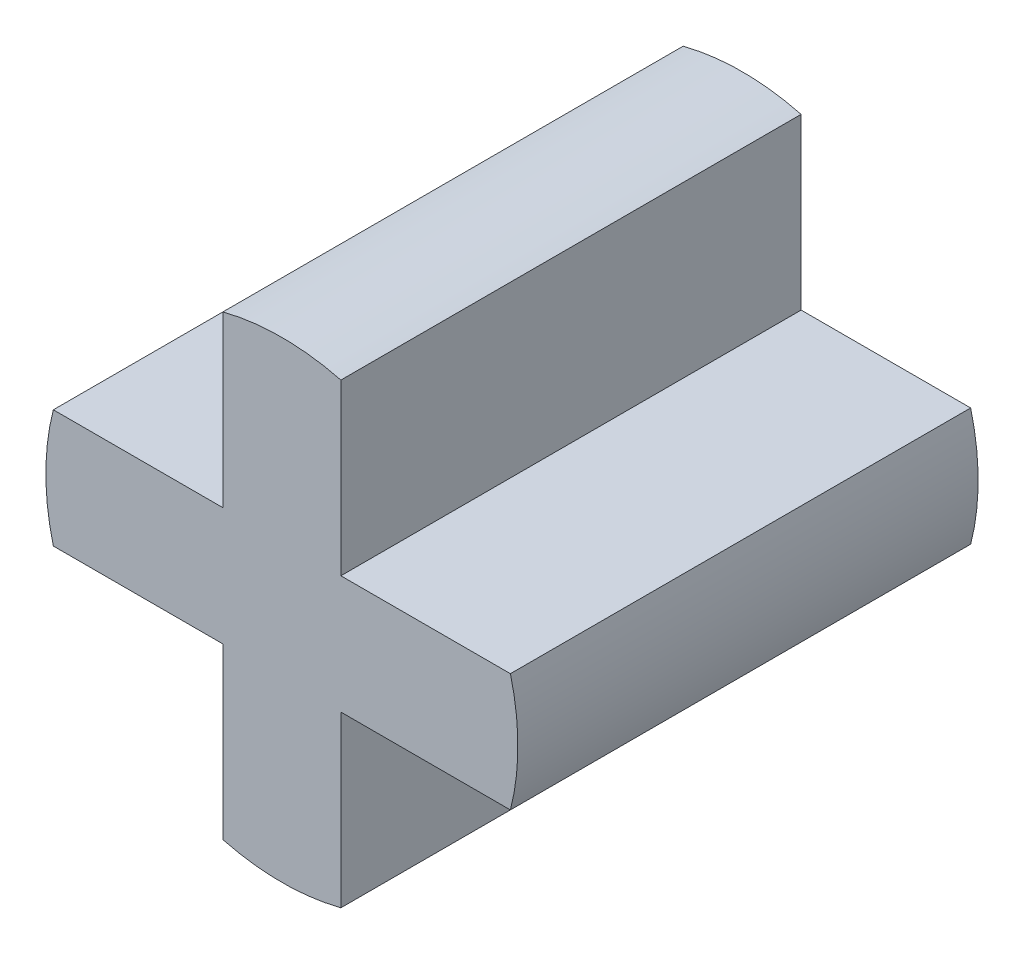
ISO-10303-21;
HEADER;
FILE_DESCRIPTION(('STEP AP214'),'2;1');
FILE_NAME('part.step','',(''),(''),'','','');
FILE_SCHEMA(('AUTOMOTIVE_DESIGN { 1 0 10303 214 1 1 1 1 }'));
ENDSEC;
DATA;
#1=APPLICATION_CONTEXT('core data for automotive mechanical design processes');
#2=APPLICATION_PROTOCOL_DEFINITION('international standard','automotive_design',2000,#1);
#3=PRODUCT_CONTEXT('',#1,'mechanical');
#4=PRODUCT('Part','Part','',(#3));
#5=PRODUCT_RELATED_PRODUCT_CATEGORY('part','',(#4));
#6=PRODUCT_DEFINITION_FORMATION('','',#4);
#7=PRODUCT_DEFINITION_CONTEXT('part definition',#1,'design');
#8=PRODUCT_DEFINITION('design','',#6,#7);
#9=PRODUCT_DEFINITION_SHAPE('','',#8);
#10=(LENGTH_UNIT() NAMED_UNIT(*) SI_UNIT(.MILLI.,.METRE.));
#11=(NAMED_UNIT(*) PLANE_ANGLE_UNIT() SI_UNIT($,.RADIAN.));
#12=(NAMED_UNIT(*) SI_UNIT($,.STERADIAN.) SOLID_ANGLE_UNIT());
#13=UNCERTAINTY_MEASURE_WITH_UNIT(LENGTH_MEASURE(1.E-05),#10,'distance_accuracy_value','');
#14=(GEOMETRIC_REPRESENTATION_CONTEXT(3) GLOBAL_UNCERTAINTY_ASSIGNED_CONTEXT((#13)) GLOBAL_UNIT_ASSIGNED_CONTEXT((#10,
#11,#12)) REPRESENTATION_CONTEXT('',''));
#15=CARTESIAN_POINT('',(0.,0.,0.));
#16=DIRECTION('',(0.,0.,1.));
#17=DIRECTION('',(1.,0.,0.));
#18=AXIS2_PLACEMENT_3D('',#15,#16,#17);
#19=CARTESIAN_POINT('',(3.87298334620742,0.999999999999999,7.8));
#20=DIRECTION('',(0.,-1.,0.));
#21=DIRECTION('',(1.,0.,0.));
#22=AXIS2_PLACEMENT_3D('',#19,#20,#21);
#23=PLANE('',#22);
#24=DIRECTION('',(-1.,0.,0.));
#25=VECTOR('',#24,1.);
#26=CARTESIAN_POINT('',(3.87298334620742,0.999999999999999,0.));
#27=LINE('',#26,#25);
#28=CARTESIAN_POINT('',(3.87298334620742,1.,0.));
#29=VERTEX_POINT('',#28);
#30=CARTESIAN_POINT('',(1.,1.,0.));
#31=VERTEX_POINT('',#30);
#32=EDGE_CURVE('E153',#29,#31,#27,.T.);
#33=ORIENTED_EDGE('',*,*,#32,.T.);
#34=DIRECTION('',(0.,0.,-1.));
#35=VECTOR('',#34,1.);
#36=CARTESIAN_POINT('',(1.,1.,7.8));
#37=LINE('',#36,#35);
#38=CARTESIAN_POINT('',(1.,1.,7.8));
#39=VERTEX_POINT('',#38);
#40=EDGE_CURVE('E11',#39,#31,#37,.T.);
#41=ORIENTED_EDGE('',*,*,#40,.F.);
#42=DIRECTION('',(-1.,0.,0.));
#43=VECTOR('',#42,1.);
#44=CARTESIAN_POINT('',(3.87298334620742,0.999999999999999,7.8));
#45=LINE('',#44,#43);
#46=CARTESIAN_POINT('',(3.87298334620742,1.,7.8));
#47=VERTEX_POINT('',#46);
#48=EDGE_CURVE('E175',#47,#39,#45,.T.);
#49=ORIENTED_EDGE('',*,*,#48,.F.);
#50=DIRECTION('',(0.,0.,-1.));
#51=VECTOR('',#50,1.);
#52=CARTESIAN_POINT('',(3.87298334620742,1.,7.8));
#53=LINE('',#52,#51);
#54=EDGE_CURVE('E149',#47,#29,#53,.T.);
#55=ORIENTED_EDGE('',*,*,#54,.T.);
#56=EDGE_LOOP('',(#33,#41,#49,#55));
#57=FACE_BOUND('',#56,.T.);
#58=ADVANCED_FACE('F33',(#57),#23,.F.);
#59=CARTESIAN_POINT('',(1.,1.,7.8));
#60=DIRECTION('',(-1.,0.,0.));
#61=DIRECTION('',(0.,-1.,0.));
#62=AXIS2_PLACEMENT_3D('',#59,#60,#61);
#63=PLANE('',#62);
#64=DIRECTION('',(0.,1.,0.));
#65=VECTOR('',#64,1.);
#66=CARTESIAN_POINT('',(1.,1.,0.));
#67=LINE('',#66,#65);
#68=CARTESIAN_POINT('',(0.999999999999999,3.87298334620742,0.));
#69=VERTEX_POINT('',#68);
#70=EDGE_CURVE('E156',#31,#69,#67,.T.);
#71=ORIENTED_EDGE('',*,*,#70,.T.);
#72=DIRECTION('',(0.,0.,-1.));
#73=VECTOR('',#72,1.);
#74=CARTESIAN_POINT('',(0.999999999999999,3.87298334620742,7.8));
#75=LINE('',#74,#73);
#76=CARTESIAN_POINT('',(0.999999999999999,3.87298334620742,7.8));
#77=VERTEX_POINT('',#76);
#78=EDGE_CURVE('E41',#77,#69,#75,.T.);
#79=ORIENTED_EDGE('',*,*,#78,.F.);
#80=DIRECTION('',(0.,1.,0.));
#81=VECTOR('',#80,1.);
#82=CARTESIAN_POINT('',(1.,1.,7.8));
#83=LINE('',#82,#81);
#84=EDGE_CURVE('E104',#39,#77,#83,.T.);
#85=ORIENTED_EDGE('',*,*,#84,.F.);
#86=ORIENTED_EDGE('',*,*,#40,.T.);
#87=EDGE_LOOP('',(#71,#79,#85,#86));
#88=FACE_BOUND('',#87,.T.);
#89=ADVANCED_FACE('F253',(#88),#63,.F.);
#90=CARTESIAN_POINT('',(0.,0.,7.8));
#91=DIRECTION('',(0.,0.,-1.));
#92=DIRECTION('',(-1.,0.,0.));
#93=AXIS2_PLACEMENT_3D('',#90,#91,#92);
#94=CYLINDRICAL_SURFACE('',#93,4.);
#95=CARTESIAN_POINT('',(0.,0.,0.));
#96=DIRECTION('',(0.,0.,1.));
#97=DIRECTION('',(1.,0.,0.));
#98=AXIS2_PLACEMENT_3D('',#95,#96,#97);
#99=CIRCLE('',#98,4.);
#100=CARTESIAN_POINT('',(-1.,3.87298334620742,0.));
#101=VERTEX_POINT('',#100);
#102=EDGE_CURVE('E158',#69,#101,#99,.T.);
#103=ORIENTED_EDGE('',*,*,#102,.T.);
#104=DIRECTION('',(0.,0.,-1.));
#105=VECTOR('',#104,1.);
#106=CARTESIAN_POINT('',(-1.,3.87298334620742,7.8));
#107=LINE('',#106,#105);
#108=CARTESIAN_POINT('',(-1.,3.87298334620742,7.8));
#109=VERTEX_POINT('',#108);
#110=EDGE_CURVE('E194',#109,#101,#107,.T.);
#111=ORIENTED_EDGE('',*,*,#110,.F.);
#112=CARTESIAN_POINT('',(0.,0.,7.8));
#113=DIRECTION('',(0.,0.,1.));
#114=DIRECTION('',(1.,0.,0.));
#115=AXIS2_PLACEMENT_3D('',#112,#113,#114);
#116=CIRCLE('',#115,4.);
#117=EDGE_CURVE('E202',#77,#109,#116,.T.);
#118=ORIENTED_EDGE('',*,*,#117,.F.);
#119=ORIENTED_EDGE('',*,*,#78,.T.);
#120=EDGE_LOOP('',(#103,#111,#118,#119));
#121=FACE_BOUND('',#120,.T.);
#122=ADVANCED_FACE('F200',(#121),#94,.T.);
#123=CARTESIAN_POINT('',(-1.,3.87298334620742,7.8));
#124=DIRECTION('',(1.,0.,0.));
#125=DIRECTION('',(0.,1.,0.));
#126=AXIS2_PLACEMENT_3D('',#123,#124,#125);
#127=PLANE('',#126);
#128=DIRECTION('',(0.,-1.,0.));
#129=VECTOR('',#128,1.);
#130=CARTESIAN_POINT('',(-1.,3.87298334620742,0.));
#131=LINE('',#130,#129);
#132=CARTESIAN_POINT('',(-1.,1.,0.));
#133=VERTEX_POINT('',#132);
#134=EDGE_CURVE('E160',#101,#133,#131,.T.);
#135=ORIENTED_EDGE('',*,*,#134,.T.);
#136=DIRECTION('',(0.,0.,-1.));
#137=VECTOR('',#136,1.);
#138=CARTESIAN_POINT('',(-1.,1.,7.8));
#139=LINE('',#138,#137);
#140=CARTESIAN_POINT('',(-1.,1.,7.8));
#141=VERTEX_POINT('',#140);
#142=EDGE_CURVE('E191',#141,#133,#139,.T.);
#143=ORIENTED_EDGE('',*,*,#142,.F.);
#144=DIRECTION('',(0.,-1.,0.));
#145=VECTOR('',#144,1.);
#146=CARTESIAN_POINT('',(-1.,3.87298334620742,7.8));
#147=LINE('',#146,#145);
#148=EDGE_CURVE('E220',#109,#141,#147,.T.);
#149=ORIENTED_EDGE('',*,*,#148,.F.);
#150=ORIENTED_EDGE('',*,*,#110,.T.);
#151=EDGE_LOOP('',(#135,#143,#149,#150));
#152=FACE_BOUND('',#151,.T.);
#153=ADVANCED_FACE('F211',(#152),#127,.F.);
#154=CARTESIAN_POINT('',(-1.,1.,7.8));
#155=DIRECTION('',(0.,-1.,0.));
#156=DIRECTION('',(1.,0.,0.));
#157=AXIS2_PLACEMENT_3D('',#154,#155,#156);
#158=PLANE('',#157);
#159=DIRECTION('',(-1.,0.,0.));
#160=VECTOR('',#159,1.);
#161=CARTESIAN_POINT('',(-1.,1.,0.));
#162=LINE('',#161,#160);
#163=CARTESIAN_POINT('',(-3.87298334620742,0.999999999999999,0.));
#164=VERTEX_POINT('',#163);
#165=EDGE_CURVE('E162',#133,#164,#162,.T.);
#166=ORIENTED_EDGE('',*,*,#165,.T.);
#167=DIRECTION('',(0.,0.,-1.));
#168=VECTOR('',#167,1.);
#169=CARTESIAN_POINT('',(-3.87298334620742,0.999999999999999,7.8));
#170=LINE('',#169,#168);
#171=CARTESIAN_POINT('',(-3.87298334620742,0.999999999999999,7.8));
#172=VERTEX_POINT('',#171);
#173=EDGE_CURVE('E188',#172,#164,#170,.T.);
#174=ORIENTED_EDGE('',*,*,#173,.F.);
#175=DIRECTION('',(-1.,0.,0.));
#176=VECTOR('',#175,1.);
#177=CARTESIAN_POINT('',(-1.,1.,7.8));
#178=LINE('',#177,#176);
#179=EDGE_CURVE('E217',#141,#172,#178,.T.);
#180=ORIENTED_EDGE('',*,*,#179,.F.);
#181=ORIENTED_EDGE('',*,*,#142,.T.);
#182=EDGE_LOOP('',(#166,#174,#180,#181));
#183=FACE_BOUND('',#182,.T.);
#184=ADVANCED_FACE('F215',(#183),#158,.F.);
#185=CARTESIAN_POINT('',(0.,0.,7.8));
#186=DIRECTION('',(0.,0.,-1.));
#187=DIRECTION('',(-1.,0.,0.));
#188=AXIS2_PLACEMENT_3D('',#185,#186,#187);
#189=CYLINDRICAL_SURFACE('',#188,4.);
#190=CARTESIAN_POINT('',(0.,0.,0.));
#191=DIRECTION('',(0.,0.,1.));
#192=DIRECTION('',(1.,0.,0.));
#193=AXIS2_PLACEMENT_3D('',#190,#191,#192);
#194=CIRCLE('',#193,4.);
#195=CARTESIAN_POINT('',(-3.87298334620742,-0.999999999999999,0.));
#196=VERTEX_POINT('',#195);
#197=EDGE_CURVE('E164',#164,#196,#194,.T.);
#198=ORIENTED_EDGE('',*,*,#197,.T.);
#199=DIRECTION('',(0.,0.,-1.));
#200=VECTOR('',#199,1.);
#201=CARTESIAN_POINT('',(-3.87298334620742,-0.999999999999999,7.8));
#202=LINE('',#201,#200);
#203=CARTESIAN_POINT('',(-3.87298334620742,-0.999999999999999,7.8));
#204=VERTEX_POINT('',#203);
#205=EDGE_CURVE('E185',#204,#196,#202,.T.);
#206=ORIENTED_EDGE('',*,*,#205,.F.);
#207=CARTESIAN_POINT('',(0.,0.,7.8));
#208=DIRECTION('',(0.,0.,1.));
#209=DIRECTION('',(1.,0.,0.));
#210=AXIS2_PLACEMENT_3D('',#207,#208,#209);
#211=CIRCLE('',#210,4.);
#212=EDGE_CURVE('E219',#172,#204,#211,.T.);
#213=ORIENTED_EDGE('',*,*,#212,.F.);
#214=ORIENTED_EDGE('',*,*,#173,.T.);
#215=EDGE_LOOP('',(#198,#206,#213,#214));
#216=FACE_BOUND('',#215,.T.);
#217=ADVANCED_FACE('F266',(#216),#189,.T.);
#218=CARTESIAN_POINT('',(-3.87298334620742,-0.999999999999999,7.8));
#219=DIRECTION('',(0.,1.,0.));
#220=DIRECTION('',(-1.,0.,0.));
#221=AXIS2_PLACEMENT_3D('',#218,#219,#220);
#222=PLANE('',#221);
#223=DIRECTION('',(1.,0.,0.));
#224=VECTOR('',#223,1.);
#225=CARTESIAN_POINT('',(-3.87298334620742,-0.999999999999999,0.));
#226=LINE('',#225,#224);
#227=CARTESIAN_POINT('',(-1.,-1.,0.));
#228=VERTEX_POINT('',#227);
#229=EDGE_CURVE('E166',#196,#228,#226,.T.);
#230=ORIENTED_EDGE('',*,*,#229,.T.);
#231=DIRECTION('',(0.,0.,-1.));
#232=VECTOR('',#231,1.);
#233=CARTESIAN_POINT('',(-1.,-1.,7.8));
#234=LINE('',#233,#232);
#235=CARTESIAN_POINT('',(-1.,-1.,7.8));
#236=VERTEX_POINT('',#235);
#237=EDGE_CURVE('E182',#236,#228,#234,.T.);
#238=ORIENTED_EDGE('',*,*,#237,.F.);
#239=DIRECTION('',(1.,0.,0.));
#240=VECTOR('',#239,1.);
#241=CARTESIAN_POINT('',(-3.87298334620742,-0.999999999999999,7.8));
#242=LINE('',#241,#240);
#243=EDGE_CURVE('E222',#204,#236,#242,.T.);
#244=ORIENTED_EDGE('',*,*,#243,.F.);
#245=ORIENTED_EDGE('',*,*,#205,.T.);
#246=EDGE_LOOP('',(#230,#238,#244,#245));
#247=FACE_BOUND('',#246,.T.);
#248=ADVANCED_FACE('F269',(#247),#222,.F.);
#249=CARTESIAN_POINT('',(-1.,-1.,7.8));
#250=DIRECTION('',(1.,0.,0.));
#251=DIRECTION('',(0.,1.,0.));
#252=AXIS2_PLACEMENT_3D('',#249,#250,#251);
#253=PLANE('',#252);
#254=DIRECTION('',(0.,-1.,0.));
#255=VECTOR('',#254,1.);
#256=CARTESIAN_POINT('',(-1.,-1.,0.));
#257=LINE('',#256,#255);
#258=CARTESIAN_POINT('',(-1.,-3.87298334620742,0.));
#259=VERTEX_POINT('',#258);
#260=EDGE_CURVE('E168',#228,#259,#257,.T.);
#261=ORIENTED_EDGE('',*,*,#260,.T.);
#262=DIRECTION('',(0.,0.,-1.));
#263=VECTOR('',#262,1.);
#264=CARTESIAN_POINT('',(-1.,-3.87298334620742,7.8));
#265=LINE('',#264,#263);
#266=CARTESIAN_POINT('',(-1.,-3.87298334620742,7.8));
#267=VERTEX_POINT('',#266);
#268=EDGE_CURVE('E179',#267,#259,#265,.T.);
#269=ORIENTED_EDGE('',*,*,#268,.F.);
#270=DIRECTION('',(0.,-1.,0.));
#271=VECTOR('',#270,1.);
#272=CARTESIAN_POINT('',(-1.,-1.,7.8));
#273=LINE('',#272,#271);
#274=EDGE_CURVE('E228',#236,#267,#273,.T.);
#275=ORIENTED_EDGE('',*,*,#274,.F.);
#276=ORIENTED_EDGE('',*,*,#237,.T.);
#277=EDGE_LOOP('',(#261,#269,#275,#276));
#278=FACE_BOUND('',#277,.T.);
#279=ADVANCED_FACE('F234',(#278),#253,.F.);
#280=CARTESIAN_POINT('',(0.,0.,7.8));
#281=DIRECTION('',(0.,0.,-1.));
#282=DIRECTION('',(-1.,0.,0.));
#283=AXIS2_PLACEMENT_3D('',#280,#281,#282);
#284=CYLINDRICAL_SURFACE('',#283,4.);
#285=CARTESIAN_POINT('',(0.,0.,0.));
#286=DIRECTION('',(0.,0.,1.));
#287=DIRECTION('',(1.,0.,0.));
#288=AXIS2_PLACEMENT_3D('',#285,#286,#287);
#289=CIRCLE('',#288,4.);
#290=CARTESIAN_POINT('',(0.999999999999997,-3.87298334620742,0.));
#291=VERTEX_POINT('',#290);
#292=EDGE_CURVE('E170',#259,#291,#289,.T.);
#293=ORIENTED_EDGE('',*,*,#292,.T.);
#294=DIRECTION('',(0.,0.,-1.));
#295=VECTOR('',#294,1.);
#296=CARTESIAN_POINT('',(0.999999999999997,-3.87298334620742,7.8));
#297=LINE('',#296,#295);
#298=CARTESIAN_POINT('',(0.999999999999997,-3.87298334620742,7.8));
#299=VERTEX_POINT('',#298);
#300=EDGE_CURVE('E144',#299,#291,#297,.T.);
#301=ORIENTED_EDGE('',*,*,#300,.F.);
#302=CARTESIAN_POINT('',(0.,0.,7.8));
#303=DIRECTION('',(0.,0.,1.));
#304=DIRECTION('',(1.,0.,0.));
#305=AXIS2_PLACEMENT_3D('',#302,#303,#304);
#306=CIRCLE('',#305,4.);
#307=EDGE_CURVE('E135',#267,#299,#306,.T.);
#308=ORIENTED_EDGE('',*,*,#307,.F.);
#309=ORIENTED_EDGE('',*,*,#268,.T.);
#310=EDGE_LOOP('',(#293,#301,#308,#309));
#311=FACE_BOUND('',#310,.T.);
#312=ADVANCED_FACE('F238',(#311),#284,.T.);
#313=CARTESIAN_POINT('',(0.999999999999999,-3.87298334620742,7.8));
#314=DIRECTION('',(-1.,0.,0.));
#315=DIRECTION('',(0.,-1.,0.));
#316=AXIS2_PLACEMENT_3D('',#313,#314,#315);
#317=PLANE('',#316);
#318=DIRECTION('',(0.,1.,0.));
#319=VECTOR('',#318,1.);
#320=CARTESIAN_POINT('',(0.999999999999999,-3.87298334620742,0.));
#321=LINE('',#320,#319);
#322=CARTESIAN_POINT('',(0.999999999999999,-1.,0.));
#323=VERTEX_POINT('',#322);
#324=EDGE_CURVE('E143',#291,#323,#321,.T.);
#325=ORIENTED_EDGE('',*,*,#324,.T.);
#326=DIRECTION('',(0.,0.,-1.));
#327=VECTOR('',#326,1.);
#328=CARTESIAN_POINT('',(0.999999999999999,-1.,7.8));
#329=LINE('',#328,#327);
#330=CARTESIAN_POINT('',(0.999999999999999,-1.,7.8));
#331=VERTEX_POINT('',#330);
#332=EDGE_CURVE('E140',#331,#323,#329,.T.);
#333=ORIENTED_EDGE('',*,*,#332,.F.);
#334=DIRECTION('',(0.,1.,0.));
#335=VECTOR('',#334,1.);
#336=CARTESIAN_POINT('',(0.999999999999999,-3.87298334620742,7.8));
#337=LINE('',#336,#335);
#338=EDGE_CURVE('E129',#299,#331,#337,.T.);
#339=ORIENTED_EDGE('',*,*,#338,.F.);
#340=ORIENTED_EDGE('',*,*,#300,.T.);
#341=EDGE_LOOP('',(#325,#333,#339,#340));
#342=FACE_BOUND('',#341,.T.);
#343=ADVANCED_FACE('F141',(#342),#317,.F.);
#344=CARTESIAN_POINT('',(0.999999999999999,-1.,7.8));
#345=DIRECTION('',(0.,1.,0.));
#346=DIRECTION('',(-1.,0.,0.));
#347=AXIS2_PLACEMENT_3D('',#344,#345,#346);
#348=PLANE('',#347);
#349=DIRECTION('',(1.,0.,0.));
#350=VECTOR('',#349,1.);
#351=CARTESIAN_POINT('',(0.999999999999999,-1.,0.));
#352=LINE('',#351,#350);
#353=CARTESIAN_POINT('',(3.87298334620742,-0.999999999999999,0.));
#354=VERTEX_POINT('',#353);
#355=EDGE_CURVE('E90',#323,#354,#352,.T.);
#356=ORIENTED_EDGE('',*,*,#355,.T.);
#357=DIRECTION('',(0.,0.,-1.));
#358=VECTOR('',#357,1.);
#359=CARTESIAN_POINT('',(3.87298334620742,-0.999999999999999,7.8));
#360=LINE('',#359,#358);
#361=CARTESIAN_POINT('',(3.87298334620742,-0.999999999999999,7.8));
#362=VERTEX_POINT('',#361);
#363=EDGE_CURVE('E145',#362,#354,#360,.T.);
#364=ORIENTED_EDGE('',*,*,#363,.F.);
#365=DIRECTION('',(1.,0.,0.));
#366=VECTOR('',#365,1.);
#367=CARTESIAN_POINT('',(0.999999999999999,-1.,7.8));
#368=LINE('',#367,#366);
#369=EDGE_CURVE('E133',#331,#362,#368,.T.);
#370=ORIENTED_EDGE('',*,*,#369,.F.);
#371=ORIENTED_EDGE('',*,*,#332,.T.);
#372=EDGE_LOOP('',(#356,#364,#370,#371));
#373=FACE_BOUND('',#372,.T.);
#374=ADVANCED_FACE('F147',(#373),#348,.F.);
#375=CARTESIAN_POINT('',(0.,0.,7.8));
#376=DIRECTION('',(0.,0.,-1.));
#377=DIRECTION('',(-1.,0.,0.));
#378=AXIS2_PLACEMENT_3D('',#375,#376,#377);
#379=CYLINDRICAL_SURFACE('',#378,4.);
#380=CARTESIAN_POINT('',(0.,0.,0.));
#381=DIRECTION('',(0.,0.,1.));
#382=DIRECTION('',(1.,0.,0.));
#383=AXIS2_PLACEMENT_3D('',#380,#381,#382);
#384=CIRCLE('',#383,4.);
#385=EDGE_CURVE('E96',#354,#29,#384,.T.);
#386=ORIENTED_EDGE('',*,*,#385,.T.);
#387=ORIENTED_EDGE('',*,*,#54,.F.);
#388=CARTESIAN_POINT('',(0.,0.,7.8));
#389=DIRECTION('',(0.,0.,1.));
#390=DIRECTION('',(1.,0.,0.));
#391=AXIS2_PLACEMENT_3D('',#388,#389,#390);
#392=CIRCLE('',#391,4.);
#393=EDGE_CURVE('E49',#362,#47,#392,.T.);
#394=ORIENTED_EDGE('',*,*,#393,.F.);
#395=ORIENTED_EDGE('',*,*,#363,.T.);
#396=EDGE_LOOP('',(#386,#387,#394,#395));
#397=FACE_BOUND('',#396,.T.);
#398=ADVANCED_FACE('F242',(#397),#379,.T.);
#399=CARTESIAN_POINT('',(0.,0.,7.8));
#400=DIRECTION('',(0.,0.,1.));
#401=DIRECTION('',(1.,0.,0.));
#402=AXIS2_PLACEMENT_3D('',#399,#400,#401);
#403=PLANE('',#402);
#404=ORIENTED_EDGE('',*,*,#48,.T.);
#405=ORIENTED_EDGE('',*,*,#84,.T.);
#406=ORIENTED_EDGE('',*,*,#117,.T.);
#407=ORIENTED_EDGE('',*,*,#148,.T.);
#408=ORIENTED_EDGE('',*,*,#179,.T.);
#409=ORIENTED_EDGE('',*,*,#212,.T.);
#410=ORIENTED_EDGE('',*,*,#243,.T.);
#411=ORIENTED_EDGE('',*,*,#274,.T.);
#412=ORIENTED_EDGE('',*,*,#307,.T.);
#413=ORIENTED_EDGE('',*,*,#338,.T.);
#414=ORIENTED_EDGE('',*,*,#369,.T.);
#415=ORIENTED_EDGE('',*,*,#393,.T.);
#416=EDGE_LOOP('',(#404,#405,#406,#407,#408,#409,#410,#411,#412,#413,#414,#415));
#417=FACE_BOUND('',#416,.T.);
#418=ADVANCED_FACE('F131',(#417),#403,.T.);
#419=CARTESIAN_POINT('',(0.,0.,0.));
#420=DIRECTION('',(0.,0.,1.));
#421=DIRECTION('',(1.,0.,0.));
#422=AXIS2_PLACEMENT_3D('',#419,#420,#421);
#423=PLANE('',#422);
#424=ORIENTED_EDGE('',*,*,#32,.F.);
#425=ORIENTED_EDGE('',*,*,#385,.F.);
#426=ORIENTED_EDGE('',*,*,#355,.F.);
#427=ORIENTED_EDGE('',*,*,#324,.F.);
#428=ORIENTED_EDGE('',*,*,#292,.F.);
#429=ORIENTED_EDGE('',*,*,#260,.F.);
#430=ORIENTED_EDGE('',*,*,#229,.F.);
#431=ORIENTED_EDGE('',*,*,#197,.F.);
#432=ORIENTED_EDGE('',*,*,#165,.F.);
#433=ORIENTED_EDGE('',*,*,#134,.F.);
#434=ORIENTED_EDGE('',*,*,#102,.F.);
#435=ORIENTED_EDGE('',*,*,#70,.F.);
#436=EDGE_LOOP('',(#424,#425,#426,#427,#428,#429,#430,#431,#432,#433,#434,#435));
#437=FACE_BOUND('',#436,.T.);
#438=ADVANCED_FACE('F206',(#437),#423,.F.);
#439=CLOSED_SHELL('',(#58,#89,#122,#153,#184,#217,#248,#279,#312,#343,#374,#398,#418,#438));
#440=MANIFOLD_SOLID_BREP('B2',#439);
#441=ADVANCED_BREP_SHAPE_REPRESENTATION('',(#18,#440),#14);
#442=SHAPE_DEFINITION_REPRESENTATION(#9,#441);
ENDSEC;
END-ISO-10303-21;
